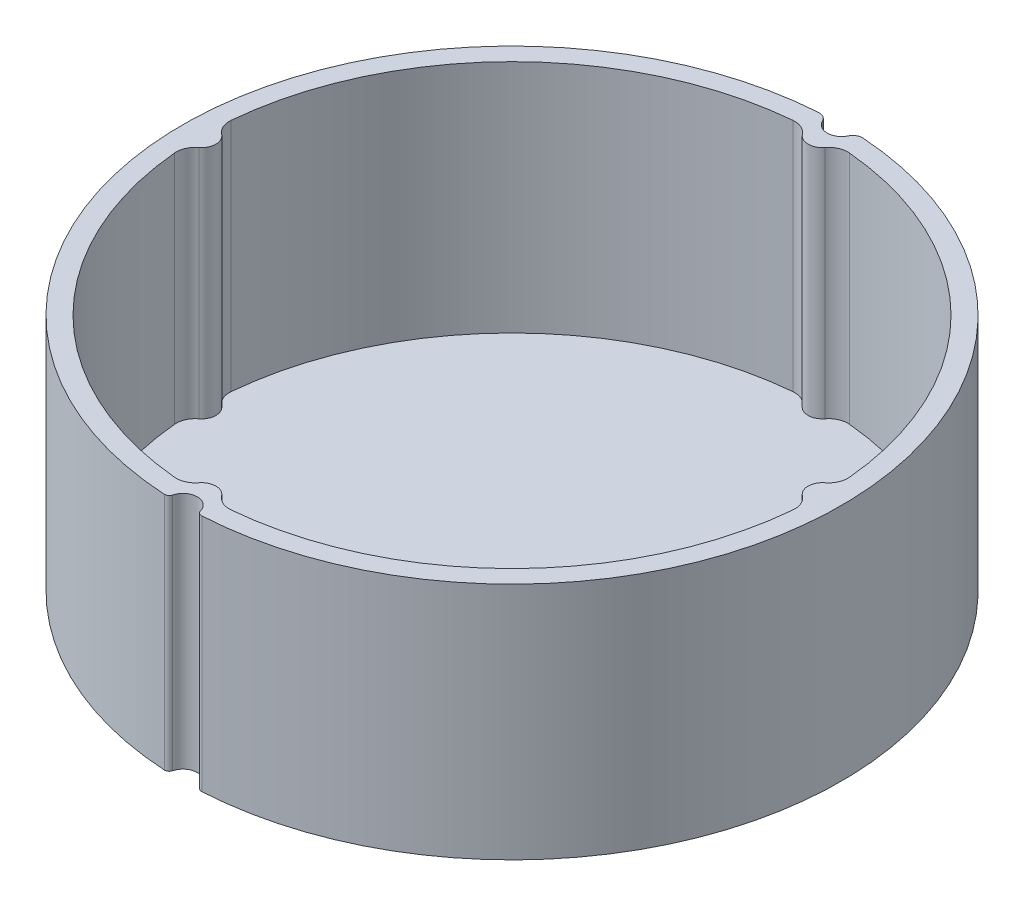
ISO-10303-21;
HEADER;
FILE_DESCRIPTION(('STEP AP214'),'2;1');
FILE_NAME('part.step','',(''),(''),'','','');
FILE_SCHEMA(('AUTOMOTIVE_DESIGN { 1 0 10303 214 1 1 1 1 }'));
ENDSEC;
DATA;
#1=APPLICATION_CONTEXT('core data for automotive mechanical design processes');
#2=APPLICATION_PROTOCOL_DEFINITION('international standard','automotive_design',2000,#1);
#3=PRODUCT_CONTEXT('',#1,'mechanical');
#4=PRODUCT('Part','Part','',(#3));
#5=PRODUCT_RELATED_PRODUCT_CATEGORY('part','',(#4));
#6=PRODUCT_DEFINITION_FORMATION('','',#4);
#7=PRODUCT_DEFINITION_CONTEXT('part definition',#1,'design');
#8=PRODUCT_DEFINITION('design','',#6,#7);
#9=PRODUCT_DEFINITION_SHAPE('','',#8);
#10=(LENGTH_UNIT() NAMED_UNIT(*) SI_UNIT(.MILLI.,.METRE.));
#11=(NAMED_UNIT(*) PLANE_ANGLE_UNIT() SI_UNIT($,.RADIAN.));
#12=(NAMED_UNIT(*) SI_UNIT($,.STERADIAN.) SOLID_ANGLE_UNIT());
#13=UNCERTAINTY_MEASURE_WITH_UNIT(LENGTH_MEASURE(1.E-05),#10,'distance_accuracy_value','');
#14=(GEOMETRIC_REPRESENTATION_CONTEXT(3) GLOBAL_UNCERTAINTY_ASSIGNED_CONTEXT((#13)) GLOBAL_UNIT_ASSIGNED_CONTEXT((#10,
#11,#12)) REPRESENTATION_CONTEXT('',''));
#15=CARTESIAN_POINT('',(0.,0.,0.));
#16=DIRECTION('',(0.,0.,1.));
#17=DIRECTION('',(1.,0.,0.));
#18=AXIS2_PLACEMENT_3D('',#15,#16,#17);
#19=CARTESIAN_POINT('',(0.,25.,0.));
#20=DIRECTION('',(0.,1.,0.));
#21=DIRECTION('',(0.,0.,1.));
#22=AXIS2_PLACEMENT_3D('',#19,#20,#21);
#23=PLANE('',#22);
#24=CARTESIAN_POINT('',(-1.93575856721061,25.,33.9428491683965));
#25=DIRECTION('',(0.,1.,0.));
#26=DIRECTION('',(0.,0.,1.));
#27=AXIS2_PLACEMENT_3D('',#24,#25,#26);
#28=CIRCLE('',#27,0.500000000000003);
#29=CARTESIAN_POINT('',(-1.45181892540796,25.,34.0685568574689));
#30=VERTEX_POINT('',#29);
#31=CARTESIAN_POINT('',(-1.96422560496371,25.,34.4420381383884));
#32=VERTEX_POINT('',#31);
#33=EDGE_CURVE('E338',#30,#32,#28,.F.);
#34=ORIENTED_EDGE('',*,*,#33,.F.);
#35=CARTESIAN_POINT('',(0.,25.,34.4456799246862));
#36=DIRECTION('',(0.,1.,0.));
#37=DIRECTION('',(0.,0.,1.));
#38=AXIS2_PLACEMENT_3D('',#35,#36,#37);
#39=CIRCLE('',#38,1.50000000000002);
#40=CARTESIAN_POINT('',(1.45181892540796,25.,34.0685568574689));
#41=VERTEX_POINT('',#40);
#42=EDGE_CURVE('E342',#41,#30,#39,.T.);
#43=ORIENTED_EDGE('',*,*,#42,.F.);
#44=CARTESIAN_POINT('',(1.93575856721061,25.,33.9428491683965));
#45=DIRECTION('',(0.,1.,0.));
#46=DIRECTION('',(0.,0.,1.));
#47=AXIS2_PLACEMENT_3D('',#44,#45,#46);
#48=CIRCLE('',#47,0.500000000000003);
#49=CARTESIAN_POINT('',(1.9642256049637,25.,34.4420381383884));
#50=VERTEX_POINT('',#49);
#51=EDGE_CURVE('E347',#41,#50,#48,.T.);
#52=ORIENTED_EDGE('',*,*,#51,.T.);
#53=CARTESIAN_POINT('',(0.,25.,-0.0020007910519898));
#54=DIRECTION('',(0.,1.,0.));
#55=DIRECTION('',(0.,0.,1.));
#56=AXIS2_PLACEMENT_3D('',#53,#54,#55);
#57=CIRCLE('',#56,34.5);
#58=CARTESIAN_POINT('',(2.32413582105506,25.,-34.4236276074198));
#59=VERTEX_POINT('',#58);
#60=EDGE_CURVE('E350',#50,#59,#57,.T.);
#61=ORIENTED_EDGE('',*,*,#60,.T.);
#62=CARTESIAN_POINT('',(2.2567695653723,25.,-33.4258992939019));
#63=DIRECTION('',(0.,1.,0.));
#64=DIRECTION('',(0.,0.,1.));
#65=AXIS2_PLACEMENT_3D('',#62,#63,#64);
#66=CIRCLE('',#65,1.);
#67=CARTESIAN_POINT('',(1.35406173922335,25.,-33.8561533823304));
#68=VERTEX_POINT('',#67);
#69=EDGE_CURVE('E353',#68,#59,#66,.F.);
#70=ORIENTED_EDGE('',*,*,#69,.F.);
#71=CARTESIAN_POINT('',(0.,25.,-34.5015345149731));
#72=DIRECTION('',(0.,1.,0.));
#73=DIRECTION('',(0.,0.,1.));
#74=AXIS2_PLACEMENT_3D('',#71,#72,#73);
#75=CIRCLE('',#74,1.49999999999991);
#76=CARTESIAN_POINT('',(-1.35406173922335,25.,-33.8561533823304));
#77=VERTEX_POINT('',#76);
#78=EDGE_CURVE('E357',#77,#68,#75,.T.);
#79=ORIENTED_EDGE('',*,*,#78,.F.);
#80=CARTESIAN_POINT('',(-2.2567695653723,25.,-33.4258992939019));
#81=DIRECTION('',(0.,1.,0.));
#82=DIRECTION('',(0.,0.,1.));
#83=AXIS2_PLACEMENT_3D('',#80,#81,#82);
#84=CIRCLE('',#83,1.);
#85=CARTESIAN_POINT('',(-2.32413582105505,25.,-34.4236276074198));
#86=VERTEX_POINT('',#85);
#87=EDGE_CURVE('E361',#77,#86,#84,.T.);
#88=ORIENTED_EDGE('',*,*,#87,.T.);
#89=CARTESIAN_POINT('',(0.,25.,-0.0020007910519898));
#90=DIRECTION('',(0.,1.,0.));
#91=DIRECTION('',(0.,0.,1.));
#92=AXIS2_PLACEMENT_3D('',#89,#90,#91);
#93=CIRCLE('',#92,34.5);
#94=EDGE_CURVE('E364',#86,#32,#93,.T.);
#95=ORIENTED_EDGE('',*,*,#94,.T.);
#96=EDGE_LOOP('',(#34,#43,#52,#61,#70,#79,#88,#95));
#97=FACE_BOUND('',#96,.T.);
#98=CARTESIAN_POINT('',(0.,25.,0.));
#99=DIRECTION('',(0.,1.,0.));
#100=DIRECTION('',(0.,0.,1.));
#101=AXIS2_PLACEMENT_3D('',#98,#99,#100);
#102=CIRCLE('',#101,32.5);
#103=CARTESIAN_POINT('',(-32.3647540983606,25.,2.96187308179258));
#104=VERTEX_POINT('',#103);
#105=CARTESIAN_POINT('',(-2.96187308179252,25.,32.3647540983606));
#106=VERTEX_POINT('',#105);
#107=EDGE_CURVE('E233',#104,#106,#102,.T.);
#108=ORIENTED_EDGE('',*,*,#107,.F.);
#109=CARTESIAN_POINT('',(-30.3730769230769,25.,2.77960396906687));
#110=DIRECTION('',(0.,1.,0.));
#111=DIRECTION('',(0.,0.,1.));
#112=AXIS2_PLACEMENT_3D('',#109,#110,#111);
#113=CIRCLE('',#112,2.);
#114=CARTESIAN_POINT('',(-31.5884615384615,25.,1.19125884388582));
#115=VERTEX_POINT('',#114);
#116=EDGE_CURVE('E229',#115,#104,#113,.T.);
#117=ORIENTED_EDGE('',*,*,#116,.F.);
#118=CARTESIAN_POINT('',(-32.5,25.,0.));
#119=DIRECTION('',(0.,-1.,0.));
#120=DIRECTION('',(0.,0.,1.));
#121=AXIS2_PLACEMENT_3D('',#118,#119,#120);
#122=CIRCLE('',#121,1.50000000000004);
#123=CARTESIAN_POINT('',(-31.5884615384615,25.,-1.19125884388582));
#124=VERTEX_POINT('',#123);
#125=EDGE_CURVE('E211',#124,#115,#122,.T.);
#126=ORIENTED_EDGE('',*,*,#125,.F.);
#127=CARTESIAN_POINT('',(-30.3730769230769,25.,-2.77960396906687));
#128=DIRECTION('',(0.,1.,0.));
#129=DIRECTION('',(0.,0.,-1.));
#130=AXIS2_PLACEMENT_3D('',#127,#128,#129);
#131=CIRCLE('',#130,2.);
#132=CARTESIAN_POINT('',(-32.3647540983606,25.,-2.96187308179257));
#133=VERTEX_POINT('',#132);
#134=EDGE_CURVE('E277',#133,#124,#131,.T.);
#135=ORIENTED_EDGE('',*,*,#134,.F.);
#136=CARTESIAN_POINT('',(0.,25.,0.));
#137=DIRECTION('',(0.,1.,0.));
#138=DIRECTION('',(0.,0.,1.));
#139=AXIS2_PLACEMENT_3D('',#136,#137,#138);
#140=CIRCLE('',#139,32.5);
#141=CARTESIAN_POINT('',(-2.96187308179252,25.,-32.3647540983607));
#142=VERTEX_POINT('',#141);
#143=EDGE_CURVE('E274',#142,#133,#140,.T.);
#144=ORIENTED_EDGE('',*,*,#143,.F.);
#145=CARTESIAN_POINT('',(-2.77960396906683,25.,-30.3730769230769));
#146=DIRECTION('',(0.,1.,0.));
#147=DIRECTION('',(0.,0.,1.));
#148=AXIS2_PLACEMENT_3D('',#145,#146,#147);
#149=CIRCLE('',#148,1.99999999999999);
#150=CARTESIAN_POINT('',(-1.19125884388578,25.,-31.5884615384615));
#151=VERTEX_POINT('',#150);
#152=EDGE_CURVE('E271',#151,#142,#149,.T.);
#153=ORIENTED_EDGE('',*,*,#152,.F.);
#154=CARTESIAN_POINT('',(0.,25.,-32.5));
#155=DIRECTION('',(0.,-1.,0.));
#156=DIRECTION('',(0.,0.,1.));
#157=AXIS2_PLACEMENT_3D('',#154,#155,#156);
#158=CIRCLE('',#157,1.50000000000001);
#159=CARTESIAN_POINT('',(1.19125884388579,25.,-31.5884615384615));
#160=VERTEX_POINT('',#159);
#161=EDGE_CURVE('E268',#160,#151,#158,.T.);
#162=ORIENTED_EDGE('',*,*,#161,.F.);
#163=CARTESIAN_POINT('',(2.77960396906683,25.,-30.3730769230769));
#164=DIRECTION('',(0.,1.,0.));
#165=DIRECTION('',(0.,0.,-1.));
#166=AXIS2_PLACEMENT_3D('',#163,#164,#165);
#167=CIRCLE('',#166,1.99999999999999);
#168=CARTESIAN_POINT('',(2.96187308179252,25.,-32.3647540983606));
#169=VERTEX_POINT('',#168);
#170=EDGE_CURVE('E265',#169,#160,#167,.T.);
#171=ORIENTED_EDGE('',*,*,#170,.F.);
#172=CARTESIAN_POINT('',(0.,25.,0.));
#173=DIRECTION('',(0.,1.,0.));
#174=DIRECTION('',(0.,0.,1.));
#175=AXIS2_PLACEMENT_3D('',#172,#173,#174);
#176=CIRCLE('',#175,32.5);
#177=CARTESIAN_POINT('',(32.3647540983606,25.,-2.96187308179253));
#178=VERTEX_POINT('',#177);
#179=EDGE_CURVE('E262',#178,#169,#176,.T.);
#180=ORIENTED_EDGE('',*,*,#179,.F.);
#181=CARTESIAN_POINT('',(30.3730769230769,25.,-2.77960396906683));
#182=DIRECTION('',(0.,1.,0.));
#183=DIRECTION('',(0.,0.,1.));
#184=AXIS2_PLACEMENT_3D('',#181,#182,#183);
#185=CIRCLE('',#184,1.99999999999999);
#186=CARTESIAN_POINT('',(31.5884615384615,25.,-1.19125884388578));
#187=VERTEX_POINT('',#186);
#188=EDGE_CURVE('E259',#187,#178,#185,.T.);
#189=ORIENTED_EDGE('',*,*,#188,.F.);
#190=CARTESIAN_POINT('',(32.5,25.,0.));
#191=DIRECTION('',(0.,-1.,0.));
#192=DIRECTION('',(0.,0.,1.));
#193=AXIS2_PLACEMENT_3D('',#190,#191,#192);
#194=CIRCLE('',#193,1.50000000000001);
#195=CARTESIAN_POINT('',(31.5884615384615,25.,1.19125884388579));
#196=VERTEX_POINT('',#195);
#197=EDGE_CURVE('E256',#196,#187,#194,.T.);
#198=ORIENTED_EDGE('',*,*,#197,.F.);
#199=CARTESIAN_POINT('',(30.3730769230769,25.,2.77960396906683));
#200=DIRECTION('',(0.,1.,0.));
#201=DIRECTION('',(0.,0.,-1.));
#202=AXIS2_PLACEMENT_3D('',#199,#200,#201);
#203=CIRCLE('',#202,1.99999999999999);
#204=CARTESIAN_POINT('',(32.3647540983606,25.,2.96187308179252));
#205=VERTEX_POINT('',#204);
#206=EDGE_CURVE('E253',#205,#196,#203,.T.);
#207=ORIENTED_EDGE('',*,*,#206,.F.);
#208=CARTESIAN_POINT('',(0.,25.,0.));
#209=DIRECTION('',(0.,1.,0.));
#210=DIRECTION('',(0.,0.,1.));
#211=AXIS2_PLACEMENT_3D('',#208,#209,#210);
#212=CIRCLE('',#211,32.5);
#213=CARTESIAN_POINT('',(2.96187308179252,25.,32.3647540983606));
#214=VERTEX_POINT('',#213);
#215=EDGE_CURVE('E250',#214,#205,#212,.T.);
#216=ORIENTED_EDGE('',*,*,#215,.F.);
#217=CARTESIAN_POINT('',(2.77960396906683,25.,30.3730769230769));
#218=DIRECTION('',(0.,1.,0.));
#219=DIRECTION('',(0.,0.,1.));
#220=AXIS2_PLACEMENT_3D('',#217,#218,#219);
#221=CIRCLE('',#220,1.99999999999999);
#222=CARTESIAN_POINT('',(1.19125884388578,25.,31.5884615384615));
#223=VERTEX_POINT('',#222);
#224=EDGE_CURVE('E247',#223,#214,#221,.T.);
#225=ORIENTED_EDGE('',*,*,#224,.F.);
#226=CARTESIAN_POINT('',(0.,25.,32.5));
#227=DIRECTION('',(0.,-1.,0.));
#228=DIRECTION('',(0.,0.,1.));
#229=AXIS2_PLACEMENT_3D('',#226,#227,#228);
#230=CIRCLE('',#229,1.50000000000001);
#231=CARTESIAN_POINT('',(-1.19125884388579,25.,31.5884615384615));
#232=VERTEX_POINT('',#231);
#233=EDGE_CURVE('E244',#232,#223,#230,.T.);
#234=ORIENTED_EDGE('',*,*,#233,.F.);
#235=CARTESIAN_POINT('',(-2.77960396906683,25.,30.3730769230769));
#236=DIRECTION('',(0.,1.,0.));
#237=DIRECTION('',(0.,0.,-1.));
#238=AXIS2_PLACEMENT_3D('',#235,#236,#237);
#239=CIRCLE('',#238,1.99999999999999);
#240=EDGE_CURVE('E241',#106,#232,#239,.T.);
#241=ORIENTED_EDGE('',*,*,#240,.F.);
#242=EDGE_LOOP('',(#108,#117,#126,#135,#144,#153,#162,#171,#180,#189,#198,#207,#216,#225,#234,#241));
#243=FACE_BOUND('',#242,.T.);
#244=ADVANCED_FACE('F41',(#97,#243),#23,.T.);
#245=CARTESIAN_POINT('',(0.,0.,0.));
#246=DIRECTION('',(0.,1.,0.));
#247=DIRECTION('',(0.,0.,1.));
#248=AXIS2_PLACEMENT_3D('',#245,#246,#247);
#249=PLANE('',#248);
#250=CARTESIAN_POINT('',(-1.93575856721061,0.,33.9428491683965));
#251=DIRECTION('',(0.,1.,0.));
#252=DIRECTION('',(0.,0.,1.));
#253=AXIS2_PLACEMENT_3D('',#250,#251,#252);
#254=CIRCLE('',#253,0.500000000000003);
#255=CARTESIAN_POINT('',(-1.45181892540796,0.,34.0685568574689));
#256=VERTEX_POINT('',#255);
#257=CARTESIAN_POINT('',(-1.96422560496371,0.,34.4420381383884));
#258=VERTEX_POINT('',#257);
#259=EDGE_CURVE('E337',#256,#258,#254,.F.);
#260=ORIENTED_EDGE('',*,*,#259,.T.);
#261=CARTESIAN_POINT('',(0.,0.,-0.0020007910519898));
#262=DIRECTION('',(0.,1.,0.));
#263=DIRECTION('',(0.,0.,1.));
#264=AXIS2_PLACEMENT_3D('',#261,#262,#263);
#265=CIRCLE('',#264,34.5);
#266=CARTESIAN_POINT('',(-2.32413582105505,0.,-34.4236276074198));
#267=VERTEX_POINT('',#266);
#268=EDGE_CURVE('E343',#267,#258,#265,.T.);
#269=ORIENTED_EDGE('',*,*,#268,.F.);
#270=CARTESIAN_POINT('',(-2.2567695653723,0.,-33.4258992939019));
#271=DIRECTION('',(0.,1.,0.));
#272=DIRECTION('',(0.,0.,1.));
#273=AXIS2_PLACEMENT_3D('',#270,#271,#272);
#274=CIRCLE('',#273,1.);
#275=CARTESIAN_POINT('',(-1.35406173922335,0.,-33.8561533823304));
#276=VERTEX_POINT('',#275);
#277=EDGE_CURVE('E390',#276,#267,#274,.T.);
#278=ORIENTED_EDGE('',*,*,#277,.F.);
#279=CARTESIAN_POINT('',(0.,0.,-34.5015345149731));
#280=DIRECTION('',(0.,1.,0.));
#281=DIRECTION('',(0.,0.,1.));
#282=AXIS2_PLACEMENT_3D('',#279,#280,#281);
#283=CIRCLE('',#282,1.49999999999991);
#284=CARTESIAN_POINT('',(1.35406173922335,0.,-33.8561533823304));
#285=VERTEX_POINT('',#284);
#286=EDGE_CURVE('E386',#276,#285,#283,.T.);
#287=ORIENTED_EDGE('',*,*,#286,.T.);
#288=CARTESIAN_POINT('',(2.2567695653723,0.,-33.4258992939019));
#289=DIRECTION('',(0.,1.,0.));
#290=DIRECTION('',(0.,0.,1.));
#291=AXIS2_PLACEMENT_3D('',#288,#289,#290);
#292=CIRCLE('',#291,1.);
#293=CARTESIAN_POINT('',(2.32413582105506,0.,-34.4236276074198));
#294=VERTEX_POINT('',#293);
#295=EDGE_CURVE('E382',#285,#294,#292,.F.);
#296=ORIENTED_EDGE('',*,*,#295,.T.);
#297=CARTESIAN_POINT('',(0.,0.,-0.0020007910519898));
#298=DIRECTION('',(0.,1.,0.));
#299=DIRECTION('',(0.,0.,1.));
#300=AXIS2_PLACEMENT_3D('',#297,#298,#299);
#301=CIRCLE('',#300,34.5);
#302=CARTESIAN_POINT('',(1.9642256049637,0.,34.4420381383884));
#303=VERTEX_POINT('',#302);
#304=EDGE_CURVE('E378',#303,#294,#301,.T.);
#305=ORIENTED_EDGE('',*,*,#304,.F.);
#306=CARTESIAN_POINT('',(1.93575856721061,0.,33.9428491683965));
#307=DIRECTION('',(0.,1.,0.));
#308=DIRECTION('',(0.,0.,1.));
#309=AXIS2_PLACEMENT_3D('',#306,#307,#308);
#310=CIRCLE('',#309,0.500000000000003);
#311=CARTESIAN_POINT('',(1.45181892540796,0.,34.0685568574689));
#312=VERTEX_POINT('',#311);
#313=EDGE_CURVE('E375',#312,#303,#310,.T.);
#314=ORIENTED_EDGE('',*,*,#313,.F.);
#315=CARTESIAN_POINT('',(0.,0.,34.4456799246862));
#316=DIRECTION('',(0.,1.,0.));
#317=DIRECTION('',(0.,0.,1.));
#318=AXIS2_PLACEMENT_3D('',#315,#316,#317);
#319=CIRCLE('',#318,1.50000000000002);
#320=EDGE_CURVE('E371',#312,#256,#319,.T.);
#321=ORIENTED_EDGE('',*,*,#320,.T.);
#322=EDGE_LOOP('',(#260,#269,#278,#287,#296,#305,#314,#321));
#323=FACE_BOUND('',#322,.T.);
#324=ADVANCED_FACE('F425',(#323),#249,.F.);
#325=CARTESIAN_POINT('',(-1.93575856721061,25.,33.9428491683965));
#326=DIRECTION('',(0.,-1.,0.));
#327=DIRECTION('',(0.,0.,-1.));
#328=AXIS2_PLACEMENT_3D('',#325,#326,#327);
#329=CYLINDRICAL_SURFACE('',#328,0.500000000000003);
#330=ORIENTED_EDGE('',*,*,#259,.F.);
#331=DIRECTION('',(0.,-1.,0.));
#332=VECTOR('',#331,1.);
#333=CARTESIAN_POINT('',(-1.45181892540796,25.,34.0685568574689));
#334=LINE('',#333,#332);
#335=EDGE_CURVE('E11',#30,#256,#334,.T.);
#336=ORIENTED_EDGE('',*,*,#335,.F.);
#337=ORIENTED_EDGE('',*,*,#33,.T.);
#338=DIRECTION('',(0.,-1.,0.));
#339=VECTOR('',#338,1.);
#340=CARTESIAN_POINT('',(-1.96422560496371,25.,34.4420381383884));
#341=LINE('',#340,#339);
#342=EDGE_CURVE('E367',#32,#258,#341,.T.);
#343=ORIENTED_EDGE('',*,*,#342,.T.);
#344=EDGE_LOOP('',(#330,#336,#337,#343));
#345=FACE_BOUND('',#344,.T.);
#346=ADVANCED_FACE('F43',(#345),#329,.T.);
#347=CARTESIAN_POINT('',(0.,25.,34.4456799246862));
#348=DIRECTION('',(0.,-1.,0.));
#349=DIRECTION('',(0.,0.,-1.));
#350=AXIS2_PLACEMENT_3D('',#347,#348,#349);
#351=CYLINDRICAL_SURFACE('',#350,1.50000000000002);
#352=ORIENTED_EDGE('',*,*,#320,.F.);
#353=DIRECTION('',(0.,-1.,0.));
#354=VECTOR('',#353,1.);
#355=CARTESIAN_POINT('',(1.45181892540796,25.,34.0685568574689));
#356=LINE('',#355,#354);
#357=EDGE_CURVE('E50',#41,#312,#356,.T.);
#358=ORIENTED_EDGE('',*,*,#357,.F.);
#359=ORIENTED_EDGE('',*,*,#42,.T.);
#360=ORIENTED_EDGE('',*,*,#335,.T.);
#361=EDGE_LOOP('',(#352,#358,#359,#360));
#362=FACE_BOUND('',#361,.T.);
#363=ADVANCED_FACE('F426',(#362),#351,.F.);
#364=CARTESIAN_POINT('',(1.93575856721061,25.,33.9428491683965));
#365=DIRECTION('',(0.,-1.,0.));
#366=DIRECTION('',(0.,0.,-1.));
#367=AXIS2_PLACEMENT_3D('',#364,#365,#366);
#368=CYLINDRICAL_SURFACE('',#367,0.500000000000003);
#369=ORIENTED_EDGE('',*,*,#313,.T.);
#370=DIRECTION('',(0.,-1.,0.));
#371=VECTOR('',#370,1.);
#372=CARTESIAN_POINT('',(1.9642256049637,25.,34.4420381383884));
#373=LINE('',#372,#371);
#374=EDGE_CURVE('E411',#50,#303,#373,.T.);
#375=ORIENTED_EDGE('',*,*,#374,.F.);
#376=ORIENTED_EDGE('',*,*,#51,.F.);
#377=ORIENTED_EDGE('',*,*,#357,.T.);
#378=EDGE_LOOP('',(#369,#375,#376,#377));
#379=FACE_BOUND('',#378,.T.);
#380=ADVANCED_FACE('F418',(#379),#368,.T.);
#381=CARTESIAN_POINT('',(0.,25.,-0.0020007910519898));
#382=DIRECTION('',(0.,-1.,0.));
#383=DIRECTION('',(0.,0.,-1.));
#384=AXIS2_PLACEMENT_3D('',#381,#382,#383);
#385=CYLINDRICAL_SURFACE('',#384,34.5);
#386=ORIENTED_EDGE('',*,*,#304,.T.);
#387=DIRECTION('',(0.,-1.,0.));
#388=VECTOR('',#387,1.);
#389=CARTESIAN_POINT('',(2.32413582105506,25.,-34.4236276074198));
#390=LINE('',#389,#388);
#391=EDGE_CURVE('E408',#59,#294,#390,.T.);
#392=ORIENTED_EDGE('',*,*,#391,.F.);
#393=ORIENTED_EDGE('',*,*,#60,.F.);
#394=ORIENTED_EDGE('',*,*,#374,.T.);
#395=EDGE_LOOP('',(#386,#392,#393,#394));
#396=FACE_BOUND('',#395,.T.);
#397=ADVANCED_FACE('F451',(#396),#385,.T.);
#398=CARTESIAN_POINT('',(2.2567695653723,25.,-33.4258992939019));
#399=DIRECTION('',(0.,-1.,0.));
#400=DIRECTION('',(0.,0.,-1.));
#401=AXIS2_PLACEMENT_3D('',#398,#399,#400);
#402=CYLINDRICAL_SURFACE('',#401,1.);
#403=ORIENTED_EDGE('',*,*,#295,.F.);
#404=DIRECTION('',(0.,-1.,0.));
#405=VECTOR('',#404,1.);
#406=CARTESIAN_POINT('',(1.35406173922335,25.,-33.8561533823304));
#407=LINE('',#406,#405);
#408=EDGE_CURVE('E405',#68,#285,#407,.T.);
#409=ORIENTED_EDGE('',*,*,#408,.F.);
#410=ORIENTED_EDGE('',*,*,#69,.T.);
#411=ORIENTED_EDGE('',*,*,#391,.T.);
#412=EDGE_LOOP('',(#403,#409,#410,#411));
#413=FACE_BOUND('',#412,.T.);
#414=ADVANCED_FACE('F446',(#413),#402,.T.);
#415=CARTESIAN_POINT('',(0.,25.,-34.5015345149731));
#416=DIRECTION('',(0.,-1.,0.));
#417=DIRECTION('',(0.,0.,-1.));
#418=AXIS2_PLACEMENT_3D('',#415,#416,#417);
#419=CYLINDRICAL_SURFACE('',#418,1.49999999999991);
#420=ORIENTED_EDGE('',*,*,#286,.F.);
#421=DIRECTION('',(0.,-1.,0.));
#422=VECTOR('',#421,1.);
#423=CARTESIAN_POINT('',(-1.35406173922335,25.,-33.8561533823304));
#424=LINE('',#423,#422);
#425=EDGE_CURVE('E402',#77,#276,#424,.T.);
#426=ORIENTED_EDGE('',*,*,#425,.F.);
#427=ORIENTED_EDGE('',*,*,#78,.T.);
#428=ORIENTED_EDGE('',*,*,#408,.T.);
#429=EDGE_LOOP('',(#420,#426,#427,#428));
#430=FACE_BOUND('',#429,.T.);
#431=ADVANCED_FACE('F443',(#430),#419,.F.);
#432=CARTESIAN_POINT('',(-2.2567695653723,25.,-33.4258992939019));
#433=DIRECTION('',(0.,-1.,0.));
#434=DIRECTION('',(0.,0.,-1.));
#435=AXIS2_PLACEMENT_3D('',#432,#433,#434);
#436=CYLINDRICAL_SURFACE('',#435,1.);
#437=ORIENTED_EDGE('',*,*,#277,.T.);
#438=DIRECTION('',(0.,-1.,0.));
#439=VECTOR('',#438,1.);
#440=CARTESIAN_POINT('',(-2.32413582105505,25.,-34.4236276074198));
#441=LINE('',#440,#439);
#442=EDGE_CURVE('E398',#86,#267,#441,.T.);
#443=ORIENTED_EDGE('',*,*,#442,.F.);
#444=ORIENTED_EDGE('',*,*,#87,.F.);
#445=ORIENTED_EDGE('',*,*,#425,.T.);
#446=EDGE_LOOP('',(#437,#443,#444,#445));
#447=FACE_BOUND('',#446,.T.);
#448=ADVANCED_FACE('F440',(#447),#436,.T.);
#449=CARTESIAN_POINT('',(0.,25.,-0.0020007910519898));
#450=DIRECTION('',(0.,-1.,0.));
#451=DIRECTION('',(0.,0.,-1.));
#452=AXIS2_PLACEMENT_3D('',#449,#450,#451);
#453=CYLINDRICAL_SURFACE('',#452,34.5);
#454=ORIENTED_EDGE('',*,*,#268,.T.);
#455=ORIENTED_EDGE('',*,*,#342,.F.);
#456=ORIENTED_EDGE('',*,*,#94,.F.);
#457=ORIENTED_EDGE('',*,*,#442,.T.);
#458=EDGE_LOOP('',(#454,#455,#456,#457));
#459=FACE_BOUND('',#458,.T.);
#460=ADVANCED_FACE('F435',(#459),#453,.T.);
#461=CARTESIAN_POINT('',(-30.3730769230769,25.,2.77960396906687));
#462=DIRECTION('',(0.,-1.,0.));
#463=DIRECTION('',(0.,0.,-1.));
#464=AXIS2_PLACEMENT_3D('',#461,#462,#463);
#465=CYLINDRICAL_SURFACE('',#464,2.);
#466=CARTESIAN_POINT('',(-30.3730769230769,0.4,2.77960396906687));
#467=DIRECTION('',(0.,1.,0.));
#468=DIRECTION('',(0.,0.,1.));
#469=AXIS2_PLACEMENT_3D('',#466,#467,#468);
#470=CIRCLE('',#469,2.);
#471=CARTESIAN_POINT('',(-31.5884615384615,0.4,1.19125884388582));
#472=VERTEX_POINT('',#471);
#473=CARTESIAN_POINT('',(-32.3647540983606,0.400000000000001,2.96187308179258));
#474=VERTEX_POINT('',#473);
#475=EDGE_CURVE('E218',#472,#474,#470,.T.);
#476=ORIENTED_EDGE('',*,*,#475,.F.);
#477=DIRECTION('',(0.,-1.,0.));
#478=VECTOR('',#477,1.);
#479=CARTESIAN_POINT('',(-31.5884615384615,25.,1.19125884388582));
#480=LINE('',#479,#478);
#481=EDGE_CURVE('E204',#115,#472,#480,.T.);
#482=ORIENTED_EDGE('',*,*,#481,.F.);
#483=ORIENTED_EDGE('',*,*,#116,.T.);
#484=DIRECTION('',(0.,-1.,0.));
#485=VECTOR('',#484,1.);
#486=CARTESIAN_POINT('',(-32.3647540983606,25.,2.96187308179258));
#487=LINE('',#486,#485);
#488=EDGE_CURVE('E220',#104,#474,#487,.T.);
#489=ORIENTED_EDGE('',*,*,#488,.T.);
#490=EDGE_LOOP('',(#476,#482,#483,#489));
#491=FACE_BOUND('',#490,.T.);
#492=ADVANCED_FACE('F219',(#491),#465,.F.);
#493=CARTESIAN_POINT('',(0.,25.,0.));
#494=DIRECTION('',(0.,-1.,0.));
#495=DIRECTION('',(0.,0.,-1.));
#496=AXIS2_PLACEMENT_3D('',#493,#494,#495);
#497=CYLINDRICAL_SURFACE('',#496,32.5);
#498=CARTESIAN_POINT('',(0.,0.4,0.));
#499=DIRECTION('',(0.,1.,0.));
#500=DIRECTION('',(0.,0.,1.));
#501=AXIS2_PLACEMENT_3D('',#498,#499,#500);
#502=CIRCLE('',#501,32.5);
#503=CARTESIAN_POINT('',(-2.96187308179252,0.400000000000001,32.3647540983606));
#504=VERTEX_POINT('',#503);
#505=EDGE_CURVE('E57',#474,#504,#502,.T.);
#506=ORIENTED_EDGE('',*,*,#505,.F.);
#507=ORIENTED_EDGE('',*,*,#488,.F.);
#508=ORIENTED_EDGE('',*,*,#107,.T.);
#509=DIRECTION('',(0.,-1.,0.));
#510=VECTOR('',#509,1.);
#511=CARTESIAN_POINT('',(-2.96187308179252,25.,32.3647540983606));
#512=LINE('',#511,#510);
#513=EDGE_CURVE('E332',#106,#504,#512,.T.);
#514=ORIENTED_EDGE('',*,*,#513,.T.);
#515=EDGE_LOOP('',(#506,#507,#508,#514));
#516=FACE_BOUND('',#515,.T.);
#517=ADVANCED_FACE('F459',(#516),#497,.F.);
#518=CARTESIAN_POINT('',(-2.77960396906683,25.,30.3730769230769));
#519=DIRECTION('',(0.,-1.,0.));
#520=DIRECTION('',(0.,0.,-1.));
#521=AXIS2_PLACEMENT_3D('',#518,#519,#520);
#522=CYLINDRICAL_SURFACE('',#521,1.99999999999999);
#523=CARTESIAN_POINT('',(-2.77960396906683,0.4,30.3730769230769));
#524=DIRECTION('',(0.,1.,0.));
#525=DIRECTION('',(0.,0.,-1.));
#526=AXIS2_PLACEMENT_3D('',#523,#524,#525);
#527=CIRCLE('',#526,1.99999999999999);
#528=CARTESIAN_POINT('',(-1.19125884388579,0.400000000000001,31.5884615384615));
#529=VERTEX_POINT('',#528);
#530=EDGE_CURVE('E65',#504,#529,#527,.T.);
#531=ORIENTED_EDGE('',*,*,#530,.F.);
#532=ORIENTED_EDGE('',*,*,#513,.F.);
#533=ORIENTED_EDGE('',*,*,#240,.T.);
#534=DIRECTION('',(0.,-1.,0.));
#535=VECTOR('',#534,1.);
#536=CARTESIAN_POINT('',(-1.19125884388579,25.,31.5884615384615));
#537=LINE('',#536,#535);
#538=EDGE_CURVE('E329',#232,#529,#537,.T.);
#539=ORIENTED_EDGE('',*,*,#538,.T.);
#540=EDGE_LOOP('',(#531,#532,#533,#539));
#541=FACE_BOUND('',#540,.T.);
#542=ADVANCED_FACE('F460',(#541),#522,.F.);
#543=CARTESIAN_POINT('',(0.,25.,32.5));
#544=DIRECTION('',(0.,-1.,0.));
#545=DIRECTION('',(0.,0.,-1.));
#546=AXIS2_PLACEMENT_3D('',#543,#544,#545);
#547=CYLINDRICAL_SURFACE('',#546,1.50000000000001);
#548=CARTESIAN_POINT('',(0.,0.4,32.5));
#549=DIRECTION('',(0.,-1.,0.));
#550=DIRECTION('',(0.,0.,1.));
#551=AXIS2_PLACEMENT_3D('',#548,#549,#550);
#552=CIRCLE('',#551,1.50000000000001);
#553=CARTESIAN_POINT('',(1.19125884388578,0.400000000000001,31.5884615384615));
#554=VERTEX_POINT('',#553);
#555=EDGE_CURVE('E466',#529,#554,#552,.T.);
#556=ORIENTED_EDGE('',*,*,#555,.F.);
#557=ORIENTED_EDGE('',*,*,#538,.F.);
#558=ORIENTED_EDGE('',*,*,#233,.T.);
#559=DIRECTION('',(0.,-1.,0.));
#560=VECTOR('',#559,1.);
#561=CARTESIAN_POINT('',(1.19125884388578,25.,31.5884615384615));
#562=LINE('',#561,#560);
#563=EDGE_CURVE('E325',#223,#554,#562,.T.);
#564=ORIENTED_EDGE('',*,*,#563,.T.);
#565=EDGE_LOOP('',(#556,#557,#558,#564));
#566=FACE_BOUND('',#565,.T.);
#567=ADVANCED_FACE('F463',(#566),#547,.T.);
#568=CARTESIAN_POINT('',(2.77960396906683,25.,30.3730769230769));
#569=DIRECTION('',(0.,-1.,0.));
#570=DIRECTION('',(0.,0.,-1.));
#571=AXIS2_PLACEMENT_3D('',#568,#569,#570);
#572=CYLINDRICAL_SURFACE('',#571,1.99999999999999);
#573=CARTESIAN_POINT('',(2.77960396906683,0.4,30.3730769230769));
#574=DIRECTION('',(0.,1.,0.));
#575=DIRECTION('',(0.,0.,1.));
#576=AXIS2_PLACEMENT_3D('',#573,#574,#575);
#577=CIRCLE('',#576,1.99999999999999);
#578=CARTESIAN_POINT('',(2.96187308179252,0.400000000000001,32.3647540983606));
#579=VERTEX_POINT('',#578);
#580=EDGE_CURVE('E482',#554,#579,#577,.T.);
#581=ORIENTED_EDGE('',*,*,#580,.F.);
#582=ORIENTED_EDGE('',*,*,#563,.F.);
#583=ORIENTED_EDGE('',*,*,#224,.T.);
#584=DIRECTION('',(0.,-1.,0.));
#585=VECTOR('',#584,1.);
#586=CARTESIAN_POINT('',(2.96187308179252,25.,32.3647540983606));
#587=LINE('',#586,#585);
#588=EDGE_CURVE('E321',#214,#579,#587,.T.);
#589=ORIENTED_EDGE('',*,*,#588,.T.);
#590=EDGE_LOOP('',(#581,#582,#583,#589));
#591=FACE_BOUND('',#590,.T.);
#592=ADVANCED_FACE('F472',(#591),#572,.F.);
#593=CARTESIAN_POINT('',(0.,25.,0.));
#594=DIRECTION('',(0.,-1.,0.));
#595=DIRECTION('',(0.,0.,-1.));
#596=AXIS2_PLACEMENT_3D('',#593,#594,#595);
#597=CYLINDRICAL_SURFACE('',#596,32.5);
#598=CARTESIAN_POINT('',(0.,0.4,0.));
#599=DIRECTION('',(0.,1.,0.));
#600=DIRECTION('',(0.,0.,1.));
#601=AXIS2_PLACEMENT_3D('',#598,#599,#600);
#602=CIRCLE('',#601,32.5);
#603=CARTESIAN_POINT('',(32.3647540983606,0.400000000000001,2.96187308179252));
#604=VERTEX_POINT('',#603);
#605=EDGE_CURVE('E478',#579,#604,#602,.T.);
#606=ORIENTED_EDGE('',*,*,#605,.F.);
#607=ORIENTED_EDGE('',*,*,#588,.F.);
#608=ORIENTED_EDGE('',*,*,#215,.T.);
#609=DIRECTION('',(0.,-1.,0.));
#610=VECTOR('',#609,1.);
#611=CARTESIAN_POINT('',(32.3647540983606,25.,2.96187308179252));
#612=LINE('',#611,#610);
#613=EDGE_CURVE('E317',#205,#604,#612,.T.);
#614=ORIENTED_EDGE('',*,*,#613,.T.);
#615=EDGE_LOOP('',(#606,#607,#608,#614));
#616=FACE_BOUND('',#615,.T.);
#617=ADVANCED_FACE('F475',(#616),#597,.F.);
#618=CARTESIAN_POINT('',(30.3730769230769,25.,2.77960396906683));
#619=DIRECTION('',(0.,-1.,0.));
#620=DIRECTION('',(0.,0.,-1.));
#621=AXIS2_PLACEMENT_3D('',#618,#619,#620);
#622=CYLINDRICAL_SURFACE('',#621,1.99999999999999);
#623=CARTESIAN_POINT('',(30.3730769230769,0.4,2.77960396906683));
#624=DIRECTION('',(0.,1.,0.));
#625=DIRECTION('',(0.,0.,-1.));
#626=AXIS2_PLACEMENT_3D('',#623,#624,#625);
#627=CIRCLE('',#626,1.99999999999999);
#628=CARTESIAN_POINT('',(31.5884615384615,0.400000000000001,1.19125884388579));
#629=VERTEX_POINT('',#628);
#630=EDGE_CURVE('E481',#604,#629,#627,.T.);
#631=ORIENTED_EDGE('',*,*,#630,.F.);
#632=ORIENTED_EDGE('',*,*,#613,.F.);
#633=ORIENTED_EDGE('',*,*,#206,.T.);
#634=DIRECTION('',(0.,-1.,0.));
#635=VECTOR('',#634,1.);
#636=CARTESIAN_POINT('',(31.5884615384615,25.,1.19125884388579));
#637=LINE('',#636,#635);
#638=EDGE_CURVE('E313',#196,#629,#637,.T.);
#639=ORIENTED_EDGE('',*,*,#638,.T.);
#640=EDGE_LOOP('',(#631,#632,#633,#639));
#641=FACE_BOUND('',#640,.T.);
#642=ADVANCED_FACE('F559',(#641),#622,.F.);
#643=CARTESIAN_POINT('',(32.5,25.,0.));
#644=DIRECTION('',(0.,-1.,0.));
#645=DIRECTION('',(0.,0.,-1.));
#646=AXIS2_PLACEMENT_3D('',#643,#644,#645);
#647=CYLINDRICAL_SURFACE('',#646,1.50000000000001);
#648=CARTESIAN_POINT('',(32.5,0.4,0.));
#649=DIRECTION('',(0.,-1.,0.));
#650=DIRECTION('',(0.,0.,1.));
#651=AXIS2_PLACEMENT_3D('',#648,#649,#650);
#652=CIRCLE('',#651,1.50000000000001);
#653=CARTESIAN_POINT('',(31.5884615384615,0.400000000000001,-1.19125884388578));
#654=VERTEX_POINT('',#653);
#655=EDGE_CURVE('E486',#629,#654,#652,.T.);
#656=ORIENTED_EDGE('',*,*,#655,.F.);
#657=ORIENTED_EDGE('',*,*,#638,.F.);
#658=ORIENTED_EDGE('',*,*,#197,.T.);
#659=DIRECTION('',(0.,-1.,0.));
#660=VECTOR('',#659,1.);
#661=CARTESIAN_POINT('',(31.5884615384615,25.,-1.19125884388578));
#662=LINE('',#661,#660);
#663=EDGE_CURVE('E309',#187,#654,#662,.T.);
#664=ORIENTED_EDGE('',*,*,#663,.T.);
#665=EDGE_LOOP('',(#656,#657,#658,#664));
#666=FACE_BOUND('',#665,.T.);
#667=ADVANCED_FACE('F555',(#666),#647,.T.);
#668=CARTESIAN_POINT('',(30.3730769230769,25.,-2.77960396906683));
#669=DIRECTION('',(0.,-1.,0.));
#670=DIRECTION('',(0.,0.,-1.));
#671=AXIS2_PLACEMENT_3D('',#668,#669,#670);
#672=CYLINDRICAL_SURFACE('',#671,1.99999999999999);
#673=CARTESIAN_POINT('',(30.3730769230769,0.4,-2.77960396906683));
#674=DIRECTION('',(0.,1.,0.));
#675=DIRECTION('',(0.,0.,1.));
#676=AXIS2_PLACEMENT_3D('',#673,#674,#675);
#677=CIRCLE('',#676,1.99999999999999);
#678=CARTESIAN_POINT('',(32.3647540983606,0.400000000000001,-2.96187308179253));
#679=VERTEX_POINT('',#678);
#680=EDGE_CURVE('E494',#654,#679,#677,.T.);
#681=ORIENTED_EDGE('',*,*,#680,.F.);
#682=ORIENTED_EDGE('',*,*,#663,.F.);
#683=ORIENTED_EDGE('',*,*,#188,.T.);
#684=DIRECTION('',(0.,-1.,0.));
#685=VECTOR('',#684,1.);
#686=CARTESIAN_POINT('',(32.3647540983606,25.,-2.96187308179253));
#687=LINE('',#686,#685);
#688=EDGE_CURVE('E305',#178,#679,#687,.T.);
#689=ORIENTED_EDGE('',*,*,#688,.T.);
#690=EDGE_LOOP('',(#681,#682,#683,#689));
#691=FACE_BOUND('',#690,.T.);
#692=ADVANCED_FACE('F551',(#691),#672,.F.);
#693=CARTESIAN_POINT('',(0.,25.,0.));
#694=DIRECTION('',(0.,-1.,0.));
#695=DIRECTION('',(0.,0.,-1.));
#696=AXIS2_PLACEMENT_3D('',#693,#694,#695);
#697=CYLINDRICAL_SURFACE('',#696,32.5);
#698=CARTESIAN_POINT('',(0.,0.4,0.));
#699=DIRECTION('',(0.,1.,0.));
#700=DIRECTION('',(0.,0.,1.));
#701=AXIS2_PLACEMENT_3D('',#698,#699,#700);
#702=CIRCLE('',#701,32.5);
#703=CARTESIAN_POINT('',(2.96187308179252,0.400000000000001,-32.3647540983606));
#704=VERTEX_POINT('',#703);
#705=EDGE_CURVE('E498',#679,#704,#702,.T.);
#706=ORIENTED_EDGE('',*,*,#705,.F.);
#707=ORIENTED_EDGE('',*,*,#688,.F.);
#708=ORIENTED_EDGE('',*,*,#179,.T.);
#709=DIRECTION('',(0.,-1.,0.));
#710=VECTOR('',#709,1.);
#711=CARTESIAN_POINT('',(2.96187308179252,25.,-32.3647540983606));
#712=LINE('',#711,#710);
#713=EDGE_CURVE('E301',#169,#704,#712,.T.);
#714=ORIENTED_EDGE('',*,*,#713,.T.);
#715=EDGE_LOOP('',(#706,#707,#708,#714));
#716=FACE_BOUND('',#715,.T.);
#717=ADVANCED_FACE('F547',(#716),#697,.F.);
#718=CARTESIAN_POINT('',(2.77960396906683,25.,-30.3730769230769));
#719=DIRECTION('',(0.,-1.,0.));
#720=DIRECTION('',(0.,0.,-1.));
#721=AXIS2_PLACEMENT_3D('',#718,#719,#720);
#722=CYLINDRICAL_SURFACE('',#721,1.99999999999999);
#723=CARTESIAN_POINT('',(2.77960396906683,0.4,-30.3730769230769));
#724=DIRECTION('',(0.,1.,0.));
#725=DIRECTION('',(0.,0.,-1.));
#726=AXIS2_PLACEMENT_3D('',#723,#724,#725);
#727=CIRCLE('',#726,1.99999999999999);
#728=CARTESIAN_POINT('',(1.19125884388579,0.400000000000001,-31.5884615384615));
#729=VERTEX_POINT('',#728);
#730=EDGE_CURVE('E502',#704,#729,#727,.T.);
#731=ORIENTED_EDGE('',*,*,#730,.F.);
#732=ORIENTED_EDGE('',*,*,#713,.F.);
#733=ORIENTED_EDGE('',*,*,#170,.T.);
#734=DIRECTION('',(0.,-1.,0.));
#735=VECTOR('',#734,1.);
#736=CARTESIAN_POINT('',(1.19125884388579,25.,-31.5884615384615));
#737=LINE('',#736,#735);
#738=EDGE_CURVE('E297',#160,#729,#737,.T.);
#739=ORIENTED_EDGE('',*,*,#738,.T.);
#740=EDGE_LOOP('',(#731,#732,#733,#739));
#741=FACE_BOUND('',#740,.T.);
#742=ADVANCED_FACE('F543',(#741),#722,.F.);
#743=CARTESIAN_POINT('',(0.,25.,-32.5));
#744=DIRECTION('',(0.,-1.,0.));
#745=DIRECTION('',(0.,0.,-1.));
#746=AXIS2_PLACEMENT_3D('',#743,#744,#745);
#747=CYLINDRICAL_SURFACE('',#746,1.50000000000001);
#748=CARTESIAN_POINT('',(0.,0.4,-32.5));
#749=DIRECTION('',(0.,-1.,0.));
#750=DIRECTION('',(0.,0.,1.));
#751=AXIS2_PLACEMENT_3D('',#748,#749,#750);
#752=CIRCLE('',#751,1.50000000000001);
#753=CARTESIAN_POINT('',(-1.19125884388578,0.400000000000001,-31.5884615384615));
#754=VERTEX_POINT('',#753);
#755=EDGE_CURVE('E506',#729,#754,#752,.T.);
#756=ORIENTED_EDGE('',*,*,#755,.F.);
#757=ORIENTED_EDGE('',*,*,#738,.F.);
#758=ORIENTED_EDGE('',*,*,#161,.T.);
#759=DIRECTION('',(0.,-1.,0.));
#760=VECTOR('',#759,1.);
#761=CARTESIAN_POINT('',(-1.19125884388578,25.,-31.5884615384615));
#762=LINE('',#761,#760);
#763=EDGE_CURVE('E293',#151,#754,#762,.T.);
#764=ORIENTED_EDGE('',*,*,#763,.T.);
#765=EDGE_LOOP('',(#756,#757,#758,#764));
#766=FACE_BOUND('',#765,.T.);
#767=ADVANCED_FACE('F540',(#766),#747,.T.);
#768=CARTESIAN_POINT('',(-2.77960396906683,25.,-30.3730769230769));
#769=DIRECTION('',(0.,-1.,0.));
#770=DIRECTION('',(0.,0.,-1.));
#771=AXIS2_PLACEMENT_3D('',#768,#769,#770);
#772=CYLINDRICAL_SURFACE('',#771,1.99999999999999);
#773=CARTESIAN_POINT('',(-2.77960396906683,0.4,-30.3730769230769));
#774=DIRECTION('',(0.,1.,0.));
#775=DIRECTION('',(0.,0.,1.));
#776=AXIS2_PLACEMENT_3D('',#773,#774,#775);
#777=CIRCLE('',#776,1.99999999999999);
#778=CARTESIAN_POINT('',(-2.96187308179252,0.400000000000001,-32.3647540983607));
#779=VERTEX_POINT('',#778);
#780=EDGE_CURVE('E510',#754,#779,#777,.T.);
#781=ORIENTED_EDGE('',*,*,#780,.F.);
#782=ORIENTED_EDGE('',*,*,#763,.F.);
#783=ORIENTED_EDGE('',*,*,#152,.T.);
#784=DIRECTION('',(0.,-1.,0.));
#785=VECTOR('',#784,1.);
#786=CARTESIAN_POINT('',(-2.96187308179252,25.,-32.3647540983607));
#787=LINE('',#786,#785);
#788=EDGE_CURVE('E289',#142,#779,#787,.T.);
#789=ORIENTED_EDGE('',*,*,#788,.T.);
#790=EDGE_LOOP('',(#781,#782,#783,#789));
#791=FACE_BOUND('',#790,.T.);
#792=ADVANCED_FACE('F520',(#791),#772,.F.);
#793=CARTESIAN_POINT('',(0.,25.,0.));
#794=DIRECTION('',(0.,-1.,0.));
#795=DIRECTION('',(0.,0.,-1.));
#796=AXIS2_PLACEMENT_3D('',#793,#794,#795);
#797=CYLINDRICAL_SURFACE('',#796,32.5);
#798=CARTESIAN_POINT('',(0.,0.4,0.));
#799=DIRECTION('',(0.,1.,0.));
#800=DIRECTION('',(0.,0.,1.));
#801=AXIS2_PLACEMENT_3D('',#798,#799,#800);
#802=CIRCLE('',#801,32.5);
#803=CARTESIAN_POINT('',(-32.3647540983606,0.400000000000001,-2.96187308179257));
#804=VERTEX_POINT('',#803);
#805=EDGE_CURVE('E235',#779,#804,#802,.T.);
#806=ORIENTED_EDGE('',*,*,#805,.F.);
#807=ORIENTED_EDGE('',*,*,#788,.F.);
#808=ORIENTED_EDGE('',*,*,#143,.T.);
#809=DIRECTION('',(0.,-1.,0.));
#810=VECTOR('',#809,1.);
#811=CARTESIAN_POINT('',(-32.3647540983606,25.,-2.96187308179257));
#812=LINE('',#811,#810);
#813=EDGE_CURVE('E285',#133,#804,#812,.T.);
#814=ORIENTED_EDGE('',*,*,#813,.T.);
#815=EDGE_LOOP('',(#806,#807,#808,#814));
#816=FACE_BOUND('',#815,.T.);
#817=ADVANCED_FACE('F516',(#816),#797,.F.);
#818=CARTESIAN_POINT('',(-30.3730769230769,25.,-2.77960396906687));
#819=DIRECTION('',(0.,-1.,0.));
#820=DIRECTION('',(0.,0.,-1.));
#821=AXIS2_PLACEMENT_3D('',#818,#819,#820);
#822=CYLINDRICAL_SURFACE('',#821,2.);
#823=CARTESIAN_POINT('',(-30.3730769230769,0.4,-2.77960396906687));
#824=DIRECTION('',(0.,1.,0.));
#825=DIRECTION('',(0.,0.,-1.));
#826=AXIS2_PLACEMENT_3D('',#823,#824,#825);
#827=CIRCLE('',#826,2.);
#828=CARTESIAN_POINT('',(-31.5884615384615,0.400000000000001,-1.19125884388582));
#829=VERTEX_POINT('',#828);
#830=EDGE_CURVE('E227',#804,#829,#827,.T.);
#831=ORIENTED_EDGE('',*,*,#830,.F.);
#832=ORIENTED_EDGE('',*,*,#813,.F.);
#833=ORIENTED_EDGE('',*,*,#134,.T.);
#834=DIRECTION('',(0.,-1.,0.));
#835=VECTOR('',#834,1.);
#836=CARTESIAN_POINT('',(-31.5884615384615,25.,-1.19125884388582));
#837=LINE('',#836,#835);
#838=EDGE_CURVE('E215',#124,#829,#837,.T.);
#839=ORIENTED_EDGE('',*,*,#838,.T.);
#840=EDGE_LOOP('',(#831,#832,#833,#839));
#841=FACE_BOUND('',#840,.T.);
#842=ADVANCED_FACE('F527',(#841),#822,.F.);
#843=CARTESIAN_POINT('',(-32.5,25.,0.));
#844=DIRECTION('',(0.,-1.,0.));
#845=DIRECTION('',(0.,0.,-1.));
#846=AXIS2_PLACEMENT_3D('',#843,#844,#845);
#847=CYLINDRICAL_SURFACE('',#846,1.50000000000004);
#848=CARTESIAN_POINT('',(-32.5,0.4,0.));
#849=DIRECTION('',(0.,-1.,0.));
#850=DIRECTION('',(0.,0.,1.));
#851=AXIS2_PLACEMENT_3D('',#848,#849,#850);
#852=CIRCLE('',#851,1.50000000000004);
#853=EDGE_CURVE('E208',#829,#472,#852,.T.);
#854=ORIENTED_EDGE('',*,*,#853,.F.);
#855=ORIENTED_EDGE('',*,*,#838,.F.);
#856=ORIENTED_EDGE('',*,*,#125,.T.);
#857=ORIENTED_EDGE('',*,*,#481,.T.);
#858=EDGE_LOOP('',(#854,#855,#856,#857));
#859=FACE_BOUND('',#858,.T.);
#860=ADVANCED_FACE('F206',(#859),#847,.T.);
#861=CARTESIAN_POINT('',(-15.1865384615385,0.4,1.38980198453344));
#862=DIRECTION('',(0.,1.,0.));
#863=DIRECTION('',(0.,0.,1.));
#864=AXIS2_PLACEMENT_3D('',#861,#862,#863);
#865=PLANE('',#864);
#866=ORIENTED_EDGE('',*,*,#475,.T.);
#867=ORIENTED_EDGE('',*,*,#505,.T.);
#868=ORIENTED_EDGE('',*,*,#530,.T.);
#869=ORIENTED_EDGE('',*,*,#555,.T.);
#870=ORIENTED_EDGE('',*,*,#580,.T.);
#871=ORIENTED_EDGE('',*,*,#605,.T.);
#872=ORIENTED_EDGE('',*,*,#630,.T.);
#873=ORIENTED_EDGE('',*,*,#655,.T.);
#874=ORIENTED_EDGE('',*,*,#680,.T.);
#875=ORIENTED_EDGE('',*,*,#705,.T.);
#876=ORIENTED_EDGE('',*,*,#730,.T.);
#877=ORIENTED_EDGE('',*,*,#755,.T.);
#878=ORIENTED_EDGE('',*,*,#780,.T.);
#879=ORIENTED_EDGE('',*,*,#805,.T.);
#880=ORIENTED_EDGE('',*,*,#830,.T.);
#881=ORIENTED_EDGE('',*,*,#853,.T.);
#882=EDGE_LOOP('',(#866,#867,#868,#869,#870,#871,#872,#873,#874,#875,#876,#877,#878,#879,#880,#881));
#883=FACE_BOUND('',#882,.T.);
#884=ADVANCED_FACE('F225',(#883),#865,.T.);
#885=CLOSED_SHELL('',(#244,#324,#346,#363,#380,#397,#414,#431,#448,#460,#492,#517,#542,#567,
#592,#617,#642,#667,#692,#717,#742,#767,#792,#817,#842,#860,#884));
#886=MANIFOLD_SOLID_BREP('B2',#885);
#887=ADVANCED_BREP_SHAPE_REPRESENTATION('',(#18,#886),#14);
#888=SHAPE_DEFINITION_REPRESENTATION(#9,#887);
ENDSEC;
END-ISO-10303-21;
